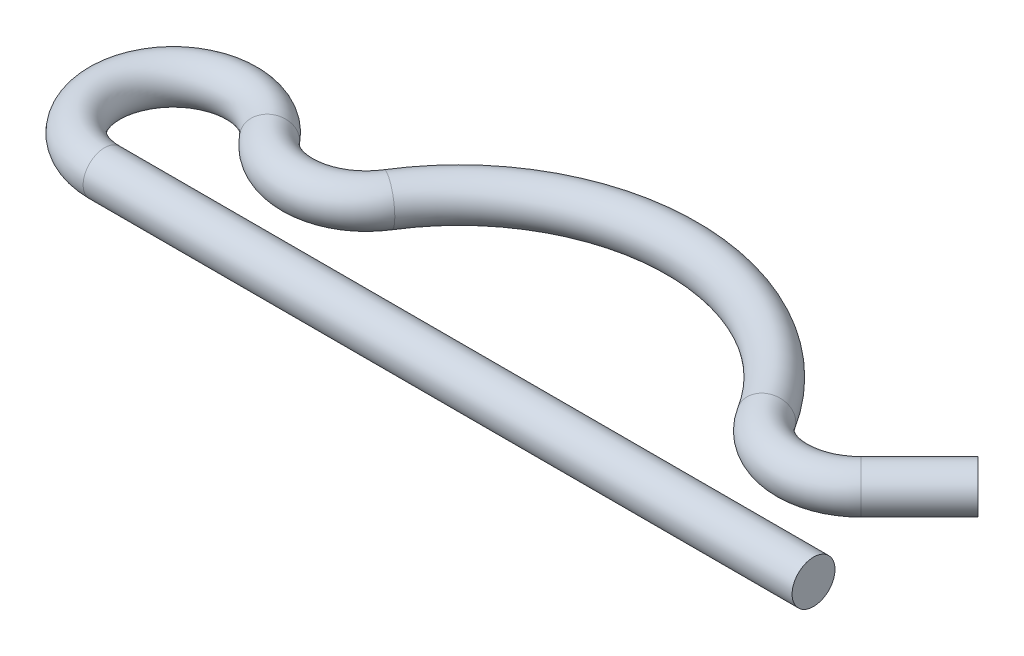
ISO-10303-21;
HEADER;
FILE_DESCRIPTION(('STEP AP214'),'2;1');
FILE_NAME('part.step','',(''),(''),'','','');
FILE_SCHEMA(('AUTOMOTIVE_DESIGN { 1 0 10303 214 1 1 1 1 }'));
ENDSEC;
DATA;
#1=APPLICATION_CONTEXT('core data for automotive mechanical design processes');
#2=APPLICATION_PROTOCOL_DEFINITION('international standard','automotive_design',2000,#1);
#3=PRODUCT_CONTEXT('',#1,'mechanical');
#4=PRODUCT('Part','Part','',(#3));
#5=PRODUCT_RELATED_PRODUCT_CATEGORY('part','',(#4));
#6=PRODUCT_DEFINITION_FORMATION('','',#4);
#7=PRODUCT_DEFINITION_CONTEXT('part definition',#1,'design');
#8=PRODUCT_DEFINITION('design','',#6,#7);
#9=PRODUCT_DEFINITION_SHAPE('','',#8);
#10=(LENGTH_UNIT() NAMED_UNIT(*) SI_UNIT(.MILLI.,.METRE.));
#11=(NAMED_UNIT(*) PLANE_ANGLE_UNIT() SI_UNIT($,.RADIAN.));
#12=(NAMED_UNIT(*) SI_UNIT($,.STERADIAN.) SOLID_ANGLE_UNIT());
#13=UNCERTAINTY_MEASURE_WITH_UNIT(LENGTH_MEASURE(1.E-05),#10,'distance_accuracy_value','');
#14=(GEOMETRIC_REPRESENTATION_CONTEXT(3) GLOBAL_UNCERTAINTY_ASSIGNED_CONTEXT((#13)) GLOBAL_UNIT_ASSIGNED_CONTEXT((#10,
#11,#12)) REPRESENTATION_CONTEXT('',''));
#15=CARTESIAN_POINT('',(0.,0.,0.));
#16=DIRECTION('',(0.,0.,1.));
#17=DIRECTION('',(1.,0.,0.));
#18=AXIS2_PLACEMENT_3D('',#15,#16,#17);
#19=CARTESIAN_POINT('',(20.6672031002534,0.,0.));
#20=DIRECTION('',(-1.,0.,0.));
#21=DIRECTION('',(0.,0.,1.));
#22=AXIS2_PLACEMENT_3D('',#19,#20,#21);
#23=PLANE('',#22);
#24=CARTESIAN_POINT('',(20.6672031002534,0.,0.));
#25=DIRECTION('',(-1.,0.,0.));
#26=DIRECTION('',(0.,0.,1.));
#27=AXIS2_PLACEMENT_3D('',#24,#25,#26);
#28=CIRCLE('',#27,1.25);
#29=CARTESIAN_POINT('',(20.6672031002534,0.,1.25000000000001));
#30=VERTEX_POINT('',#29);
#31=EDGE_CURVE('E47',#30,#30,#28,.T.);
#32=ORIENTED_EDGE('',*,*,#31,.F.);
#33=EDGE_LOOP('',(#32));
#34=FACE_BOUND('',#33,.T.);
#35=ADVANCED_FACE('F35',(#34),#23,.F.);
#36=CARTESIAN_POINT('',(20.6672031002533,0.,-9.58814374890599));
#37=DIRECTION('',(0.707106781186551,0.,-0.707106781186544));
#38=DIRECTION('',(-0.707106781186544,0.,-0.707106781186551));
#39=AXIS2_PLACEMENT_3D('',#36,#37,#38);
#40=PLANE('',#39);
#41=CARTESIAN_POINT('',(20.6672031002533,0.,-9.58814374890599));
#42=DIRECTION('',(0.707106781186551,0.,-0.707106781186544));
#43=DIRECTION('',(-0.707106781186544,0.,-0.707106781186551));
#44=AXIS2_PLACEMENT_3D('',#41,#42,#43);
#45=CIRCLE('',#44,1.25);
#46=CARTESIAN_POINT('',(19.7833196237702,0.,-10.4720272253892));
#47=VERTEX_POINT('',#46);
#48=EDGE_CURVE('E11',#47,#47,#45,.T.);
#49=ORIENTED_EDGE('',*,*,#48,.T.);
#50=EDGE_LOOP('',(#49));
#51=FACE_BOUND('',#50,.T.);
#52=ADVANCED_FACE('F50',(#51),#40,.T.);
#53=CARTESIAN_POINT('',(20.6672031002534,0.,0.));
#54=DIRECTION('',(-1.,0.,0.));
#55=DIRECTION('',(0.,0.,1.));
#56=AXIS2_PLACEMENT_3D('',#53,#54,#55);
#57=CYLINDRICAL_SURFACE('',#56,1.25);
#58=CARTESIAN_POINT('',(-20.6672031002556,0.,0.));
#59=DIRECTION('',(-1.,0.,0.));
#60=DIRECTION('',(0.,0.,1.));
#61=AXIS2_PLACEMENT_3D('',#58,#59,#60);
#62=CIRCLE('',#61,1.25);
#63=CARTESIAN_POINT('',(-20.6672031002556,0.,1.25000000000001));
#64=VERTEX_POINT('',#63);
#65=EDGE_CURVE('E70',#64,#64,#62,.T.);
#66=ORIENTED_EDGE('',*,*,#65,.F.);
#67=EDGE_LOOP('',(#66));
#68=FACE_BOUND('',#67,.T.);
#69=ORIENTED_EDGE('',*,*,#31,.T.);
#70=EDGE_LOOP('',(#69));
#71=FACE_BOUND('',#70,.T.);
#72=ADVANCED_FACE('F74',(#68,#71),#57,.T.);
#73=CARTESIAN_POINT('',(-20.6672031002556,0.,-4.));
#74=DIRECTION('',(0.,-1.,0.));
#75=DIRECTION('',(0.,0.,-1.));
#76=AXIS2_PLACEMENT_3D('',#73,#74,#75);
#77=TOROIDAL_SURFACE('',#76,4.00000000000001,1.25);
#78=CARTESIAN_POINT('',(-17.5447041010564,0.,-6.50000000000001));
#79=DIRECTION('',(0.625,0.,0.7806247497998));
#80=DIRECTION('',(0.7806247497998,0.,-0.625));
#81=AXIS2_PLACEMENT_3D('',#78,#79,#80);
#82=CIRCLE('',#81,1.25);
#83=CARTESIAN_POINT('',(-16.5689231638066,0.,-7.28125000000001));
#84=VERTEX_POINT('',#83);
#85=EDGE_CURVE('E67',#84,#84,#82,.T.);
#86=CARTESIAN_POINT('',(-20.6672031002556,0.,-4.));
#87=DIRECTION('',(0.,-1.,0.));
#88=DIRECTION('',(0.,0.,-1.));
#89=AXIS2_PLACEMENT_3D('',#86,#87,#88);
#90=CIRCLE('',#89,5.25000000000001);
#91=EDGE_CURVE('',#64,#84,#90,.T.);
#92=ORIENTED_EDGE('',*,*,#65,.T.);
#93=ORIENTED_EDGE('',*,*,#85,.F.);
#94=ORIENTED_EDGE('',*,*,#91,.T.);
#95=ORIENTED_EDGE('',*,*,#91,.F.);
#96=EDGE_LOOP('',(#92,#94,#93,#95));
#97=FACE_BOUND('',#96,.T.);
#98=ADVANCED_FACE('F76',(#97),#77,.T.);
#99=CARTESIAN_POINT('',(-14.4222051018572,0.,-9.));
#100=DIRECTION('',(0.,1.,0.));
#101=DIRECTION('',(0.,0.,1.));
#102=AXIS2_PLACEMENT_3D('',#99,#100,#101);
#103=TOROIDAL_SURFACE('',#102,3.99999999999998,1.25);
#104=CARTESIAN_POINT('',(-11.0287450778911,0.,-6.88235294117651));
#105=DIRECTION('',(0.529411764705875,0.,-0.848365005991532));
#106=DIRECTION('',(-0.848365005991531,0.,-0.529411764705875));
#107=AXIS2_PLACEMENT_3D('',#104,#105,#106);
#108=CIRCLE('',#107,1.25);
#109=CARTESIAN_POINT('',(-12.0892013353805,0.,-7.54411764705885));
#110=VERTEX_POINT('',#109);
#111=EDGE_CURVE('E62',#110,#110,#108,.T.);
#112=ORIENTED_EDGE('',*,*,#111,.F.);
#113=EDGE_LOOP('',(#112));
#114=FACE_BOUND('',#113,.T.);
#115=ORIENTED_EDGE('',*,*,#85,.T.);
#116=EDGE_LOOP('',(#115));
#117=FACE_BOUND('',#116,.T.);
#118=ADVANCED_FACE('F83',(#114,#117),#103,.T.);
#119=CARTESIAN_POINT('',(-1.11022302462516E-12,0.,-1.11022302462516E-13));
#120=DIRECTION('',(0.,-1.,0.));
#121=DIRECTION('',(0.,0.,-1.));
#122=AXIS2_PLACEMENT_3D('',#119,#120,#121);
#123=TOROIDAL_SURFACE('',#122,13.0000000000001,1.25);
#124=CARTESIAN_POINT('',(11.0287450778888,0.,-6.88235294117651));
#125=DIRECTION('',(0.529411764705875,0.,0.848365005991531));
#126=DIRECTION('',(0.848365005991531,0.,-0.529411764705875));
#127=AXIS2_PLACEMENT_3D('',#124,#125,#126);
#128=CIRCLE('',#127,1.25);
#129=CARTESIAN_POINT('',(12.0892013353783,0.,-7.54411764705886));
#130=VERTEX_POINT('',#129);
#131=EDGE_CURVE('E60',#130,#130,#128,.T.);
#132=CARTESIAN_POINT('',(-1.11022302462516E-12,0.,-1.11022302462516E-13));
#133=DIRECTION('',(0.,-1.,0.));
#134=DIRECTION('',(0.,0.,-1.));
#135=AXIS2_PLACEMENT_3D('',#132,#133,#134);
#136=CIRCLE('',#135,14.2500000000001);
#137=EDGE_CURVE('',#110,#130,#136,.T.);
#138=ORIENTED_EDGE('',*,*,#111,.T.);
#139=ORIENTED_EDGE('',*,*,#131,.F.);
#140=ORIENTED_EDGE('',*,*,#137,.T.);
#141=ORIENTED_EDGE('',*,*,#137,.F.);
#142=EDGE_LOOP('',(#138,#140,#139,#141));
#143=FACE_BOUND('',#142,.T.);
#144=ADVANCED_FACE('F90',(#143),#123,.T.);
#145=CARTESIAN_POINT('',(14.422205101855,0.,-9.));
#146=DIRECTION('',(0.,1.,0.));
#147=DIRECTION('',(0.,0.,1.));
#148=AXIS2_PLACEMENT_3D('',#145,#146,#147);
#149=TOROIDAL_SURFACE('',#148,3.99999999999998,1.25);
#150=CARTESIAN_POINT('',(17.2506322266011,0.,-6.17157287525381));
#151=DIRECTION('',(0.707106781186551,0.,-0.707106781186544));
#152=DIRECTION('',(-0.707106781186544,0.,-0.707106781186551));
#153=AXIS2_PLACEMENT_3D('',#150,#151,#152);
#154=CIRCLE('',#153,1.25);
#155=CARTESIAN_POINT('',(16.3667487501179,0.,-7.055456351737));
#156=VERTEX_POINT('',#155);
#157=EDGE_CURVE('E42',#156,#156,#154,.T.);
#158=ORIENTED_EDGE('',*,*,#157,.F.);
#159=EDGE_LOOP('',(#158));
#160=FACE_BOUND('',#159,.T.);
#161=ORIENTED_EDGE('',*,*,#131,.T.);
#162=EDGE_LOOP('',(#161));
#163=FACE_BOUND('',#162,.T.);
#164=ADVANCED_FACE('F55',(#160,#163),#149,.T.);
#165=CARTESIAN_POINT('',(17.2506322266011,0.,-6.17157287525381));
#166=DIRECTION('',(0.707106781186551,0.,-0.707106781186544));
#167=DIRECTION('',(-0.707106781186544,0.,-0.707106781186551));
#168=AXIS2_PLACEMENT_3D('',#165,#166,#167);
#169=CYLINDRICAL_SURFACE('',#168,1.25);
#170=ORIENTED_EDGE('',*,*,#48,.F.);
#171=EDGE_LOOP('',(#170));
#172=FACE_BOUND('',#171,.T.);
#173=ORIENTED_EDGE('',*,*,#157,.T.);
#174=EDGE_LOOP('',(#173));
#175=FACE_BOUND('',#174,.T.);
#176=ADVANCED_FACE('F52',(#172,#175),#169,.T.);
#177=CLOSED_SHELL('',(#35,#52,#72,#98,#118,#144,#164,#176));
#178=MANIFOLD_SOLID_BREP('B2',#177);
#179=ADVANCED_BREP_SHAPE_REPRESENTATION('',(#18,#178),#14);
#180=SHAPE_DEFINITION_REPRESENTATION(#9,#179);
ENDSEC;
END-ISO-10303-21;
